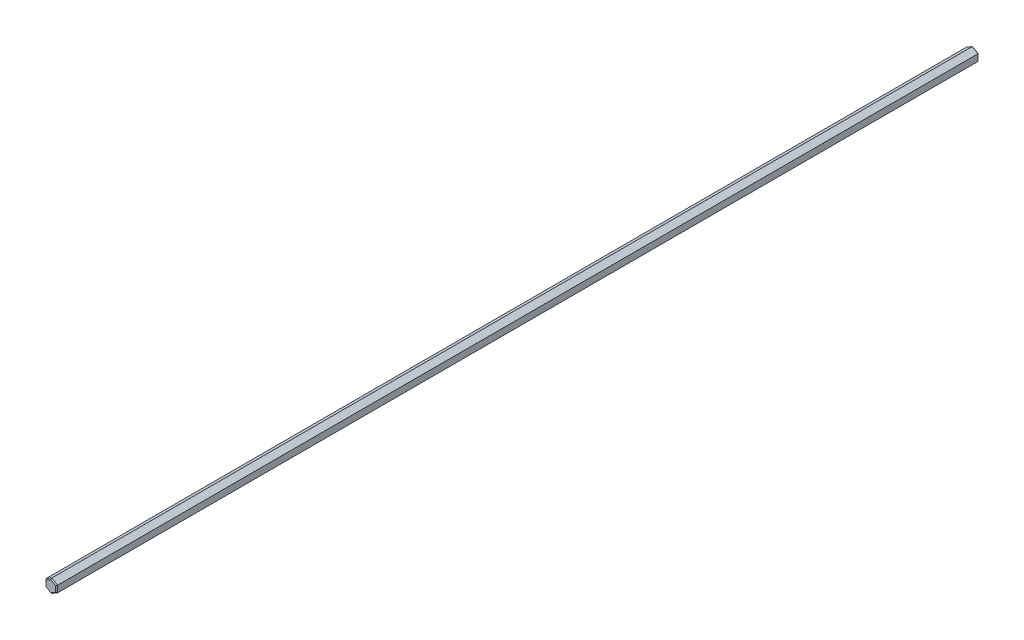
ISO-10303-21;
HEADER;
FILE_DESCRIPTION(('STEP AP214'),'2;1');
FILE_NAME('part.step','',(''),(''),'','','');
FILE_SCHEMA(('AUTOMOTIVE_DESIGN { 1 0 10303 214 1 1 1 1 }'));
ENDSEC;
DATA;
#1=APPLICATION_CONTEXT('core data for automotive mechanical design processes');
#2=APPLICATION_PROTOCOL_DEFINITION('international standard','automotive_design',2000,#1);
#3=PRODUCT_CONTEXT('',#1,'mechanical');
#4=PRODUCT('Part','Part','',(#3));
#5=PRODUCT_RELATED_PRODUCT_CATEGORY('part','',(#4));
#6=PRODUCT_DEFINITION_FORMATION('','',#4);
#7=PRODUCT_DEFINITION_CONTEXT('part definition',#1,'design');
#8=PRODUCT_DEFINITION('design','',#6,#7);
#9=PRODUCT_DEFINITION_SHAPE('','',#8);
#10=(LENGTH_UNIT() NAMED_UNIT(*) SI_UNIT(.MILLI.,.METRE.));
#11=(NAMED_UNIT(*) PLANE_ANGLE_UNIT() SI_UNIT($,.RADIAN.));
#12=(NAMED_UNIT(*) SI_UNIT($,.STERADIAN.) SOLID_ANGLE_UNIT());
#13=UNCERTAINTY_MEASURE_WITH_UNIT(LENGTH_MEASURE(1.E-05),#10,'distance_accuracy_value','');
#14=(GEOMETRIC_REPRESENTATION_CONTEXT(3) GLOBAL_UNCERTAINTY_ASSIGNED_CONTEXT((#13)) GLOBAL_UNIT_ASSIGNED_CONTEXT((#10,
#11,#12)) REPRESENTATION_CONTEXT('',''));
#15=CARTESIAN_POINT('',(0.,0.,0.));
#16=DIRECTION('',(0.,0.,1.));
#17=DIRECTION('',(1.,0.,0.));
#18=AXIS2_PLACEMENT_3D('',#15,#16,#17);
#19=CARTESIAN_POINT('',(-2.5,-1.44337567297406,0.));
#20=DIRECTION('',(-0.5,-0.866025403784439,0.));
#21=DIRECTION('',(0.866025403784439,-0.5,0.));
#22=AXIS2_PLACEMENT_3D('',#19,#20,#21);
#23=PLANE('',#22);
#24=DIRECTION('',(0.,0.,1.));
#25=VECTOR('',#24,1.);
#26=CARTESIAN_POINT('',(-2.5,-1.44337567297406,0.));
#27=LINE('',#26,#25);
#28=CARTESIAN_POINT('',(-2.5,-1.44337567297406,0.399999999999956));
#29=VERTEX_POINT('',#28);
#30=CARTESIAN_POINT('',(-2.5,-1.44337567297406,399.6));
#31=VERTEX_POINT('',#30);
#32=EDGE_CURVE('E149',#29,#31,#27,.T.);
#33=ORIENTED_EDGE('',*,*,#32,.F.);
#34=DIRECTION('',(0.866025403784439,-0.5,0.));
#35=VECTOR('',#34,1.);
#36=CARTESIAN_POINT('',(0.,-2.88675134594813,0.399999999999956));
#37=LINE('',#36,#35);
#38=CARTESIAN_POINT('',(0.,-2.88675134594813,0.399999999999956));
#39=VERTEX_POINT('',#38);
#40=EDGE_CURVE('E181',#29,#39,#37,.T.);
#41=ORIENTED_EDGE('',*,*,#40,.T.);
#42=DIRECTION('',(0.,0.,1.));
#43=VECTOR('',#42,1.);
#44=CARTESIAN_POINT('',(0.,-2.88675134594813,0.));
#45=LINE('',#44,#43);
#46=CARTESIAN_POINT('',(0.,-2.88675134594813,399.6));
#47=VERTEX_POINT('',#46);
#48=EDGE_CURVE('E214',#39,#47,#45,.T.);
#49=ORIENTED_EDGE('',*,*,#48,.T.);
#50=DIRECTION('',(-0.866025403784439,0.5,0.));
#51=VECTOR('',#50,1.);
#52=CARTESIAN_POINT('',(-2.5,-1.44337567297406,399.6));
#53=LINE('',#52,#51);
#54=EDGE_CURVE('E179',#47,#31,#53,.T.);
#55=ORIENTED_EDGE('',*,*,#54,.T.);
#56=EDGE_LOOP('',(#33,#41,#49,#55));
#57=FACE_BOUND('',#56,.T.);
#58=ADVANCED_FACE('F32',(#57),#23,.T.);
#59=CARTESIAN_POINT('',(-2.5,1.44337567297407,0.));
#60=DIRECTION('',(-1.,0.,0.));
#61=DIRECTION('',(0.,0.,1.));
#62=AXIS2_PLACEMENT_3D('',#59,#60,#61);
#63=PLANE('',#62);
#64=DIRECTION('',(0.,0.,1.));
#65=VECTOR('',#64,1.);
#66=CARTESIAN_POINT('',(-2.5,1.44337567297407,0.));
#67=LINE('',#66,#65);
#68=CARTESIAN_POINT('',(-2.5,1.44337567297407,0.399999999999956));
#69=VERTEX_POINT('',#68);
#70=CARTESIAN_POINT('',(-2.5,1.44337567297407,399.6));
#71=VERTEX_POINT('',#70);
#72=EDGE_CURVE('E130',#69,#71,#67,.T.);
#73=ORIENTED_EDGE('',*,*,#72,.F.);
#74=DIRECTION('',(0.,-1.,0.));
#75=VECTOR('',#74,1.);
#76=CARTESIAN_POINT('',(-2.5,-1.44337567297406,0.399999999999956));
#77=LINE('',#76,#75);
#78=EDGE_CURVE('E145',#69,#29,#77,.T.);
#79=ORIENTED_EDGE('',*,*,#78,.T.);
#80=ORIENTED_EDGE('',*,*,#32,.T.);
#81=DIRECTION('',(0.,1.,0.));
#82=VECTOR('',#81,1.);
#83=CARTESIAN_POINT('',(-2.5,1.44337567297407,399.6));
#84=LINE('',#83,#82);
#85=EDGE_CURVE('E148',#31,#71,#84,.T.);
#86=ORIENTED_EDGE('',*,*,#85,.T.);
#87=EDGE_LOOP('',(#73,#79,#80,#86));
#88=FACE_BOUND('',#87,.T.);
#89=ADVANCED_FACE('F142',(#88),#63,.T.);
#90=CARTESIAN_POINT('',(0.,2.88675134594813,0.));
#91=DIRECTION('',(-0.5,0.866025403784439,0.));
#92=DIRECTION('',(-0.866025403784439,-0.5,0.));
#93=AXIS2_PLACEMENT_3D('',#90,#91,#92);
#94=PLANE('',#93);
#95=DIRECTION('',(0.,0.,1.));
#96=VECTOR('',#95,1.);
#97=CARTESIAN_POINT('',(0.,2.88675134594813,0.));
#98=LINE('',#97,#96);
#99=CARTESIAN_POINT('',(0.,2.88675134594813,0.399999999999956));
#100=VERTEX_POINT('',#99);
#101=CARTESIAN_POINT('',(0.,2.88675134594813,399.6));
#102=VERTEX_POINT('',#101);
#103=EDGE_CURVE('E132',#100,#102,#98,.T.);
#104=ORIENTED_EDGE('',*,*,#103,.F.);
#105=DIRECTION('',(-0.866025403784439,-0.5,0.));
#106=VECTOR('',#105,1.);
#107=CARTESIAN_POINT('',(-2.5,1.44337567297407,0.399999999999956));
#108=LINE('',#107,#106);
#109=EDGE_CURVE('E126',#100,#69,#108,.T.);
#110=ORIENTED_EDGE('',*,*,#109,.T.);
#111=ORIENTED_EDGE('',*,*,#72,.T.);
#112=DIRECTION('',(0.866025403784439,0.5,0.));
#113=VECTOR('',#112,1.);
#114=CARTESIAN_POINT('',(0.,2.88675134594813,399.6));
#115=LINE('',#114,#113);
#116=EDGE_CURVE('E138',#71,#102,#115,.T.);
#117=ORIENTED_EDGE('',*,*,#116,.T.);
#118=EDGE_LOOP('',(#104,#110,#111,#117));
#119=FACE_BOUND('',#118,.T.);
#120=ADVANCED_FACE('F128',(#119),#94,.T.);
#121=CARTESIAN_POINT('',(2.5,1.44337567297406,0.));
#122=DIRECTION('',(0.5,0.866025403784439,0.));
#123=DIRECTION('',(-0.866025403784439,0.5,0.));
#124=AXIS2_PLACEMENT_3D('',#121,#122,#123);
#125=PLANE('',#124);
#126=DIRECTION('',(0.,0.,1.));
#127=VECTOR('',#126,1.);
#128=CARTESIAN_POINT('',(2.5,1.44337567297406,0.));
#129=LINE('',#128,#127);
#130=CARTESIAN_POINT('',(2.5,1.44337567297406,0.399999999999956));
#131=VERTEX_POINT('',#130);
#132=CARTESIAN_POINT('',(2.5,1.44337567297406,399.6));
#133=VERTEX_POINT('',#132);
#134=EDGE_CURVE('E248',#131,#133,#129,.T.);
#135=ORIENTED_EDGE('',*,*,#134,.F.);
#136=DIRECTION('',(-0.866025403784439,0.5,0.));
#137=VECTOR('',#136,1.);
#138=CARTESIAN_POINT('',(0.,2.88675134594813,0.399999999999956));
#139=LINE('',#138,#137);
#140=EDGE_CURVE('E189',#131,#100,#139,.T.);
#141=ORIENTED_EDGE('',*,*,#140,.T.);
#142=ORIENTED_EDGE('',*,*,#103,.T.);
#143=DIRECTION('',(0.866025403784439,-0.5,0.));
#144=VECTOR('',#143,1.);
#145=CARTESIAN_POINT('',(2.5,1.44337567297406,399.6));
#146=LINE('',#145,#144);
#147=EDGE_CURVE('E187',#102,#133,#146,.T.);
#148=ORIENTED_EDGE('',*,*,#147,.T.);
#149=EDGE_LOOP('',(#135,#141,#142,#148));
#150=FACE_BOUND('',#149,.T.);
#151=ADVANCED_FACE('F265',(#150),#125,.T.);
#152=CARTESIAN_POINT('',(2.5,-1.44337567297406,0.));
#153=DIRECTION('',(1.,0.,0.));
#154=DIRECTION('',(0.,0.,-1.));
#155=AXIS2_PLACEMENT_3D('',#152,#153,#154);
#156=PLANE('',#155);
#157=DIRECTION('',(0.,0.,1.));
#158=VECTOR('',#157,1.);
#159=CARTESIAN_POINT('',(2.5,-1.44337567297406,0.));
#160=LINE('',#159,#158);
#161=CARTESIAN_POINT('',(2.5,-1.44337567297406,0.399999999999956));
#162=VERTEX_POINT('',#161);
#163=CARTESIAN_POINT('',(2.5,-1.44337567297406,399.6));
#164=VERTEX_POINT('',#163);
#165=EDGE_CURVE('E246',#162,#164,#160,.T.);
#166=ORIENTED_EDGE('',*,*,#165,.F.);
#167=DIRECTION('',(0.,1.,0.));
#168=VECTOR('',#167,1.);
#169=CARTESIAN_POINT('',(2.5,1.44337567297406,0.399999999999956));
#170=LINE('',#169,#168);
#171=EDGE_CURVE('E193',#162,#131,#170,.T.);
#172=ORIENTED_EDGE('',*,*,#171,.T.);
#173=ORIENTED_EDGE('',*,*,#134,.T.);
#174=DIRECTION('',(0.,-1.,0.));
#175=VECTOR('',#174,1.);
#176=CARTESIAN_POINT('',(2.5,-1.44337567297406,399.6));
#177=LINE('',#176,#175);
#178=EDGE_CURVE('E191',#133,#164,#177,.T.);
#179=ORIENTED_EDGE('',*,*,#178,.T.);
#180=EDGE_LOOP('',(#166,#172,#173,#179));
#181=FACE_BOUND('',#180,.T.);
#182=ADVANCED_FACE('F302',(#181),#156,.T.);
#183=CARTESIAN_POINT('',(0.,-2.88675134594813,0.));
#184=DIRECTION('',(0.5,-0.866025403784439,0.));
#185=DIRECTION('',(0.866025403784439,0.5,0.));
#186=AXIS2_PLACEMENT_3D('',#183,#184,#185);
#187=PLANE('',#186);
#188=ORIENTED_EDGE('',*,*,#48,.F.);
#189=DIRECTION('',(0.866025403784439,0.5,0.));
#190=VECTOR('',#189,1.);
#191=CARTESIAN_POINT('',(2.5,-1.44337567297406,0.399999999999956));
#192=LINE('',#191,#190);
#193=EDGE_CURVE('E185',#39,#162,#192,.T.);
#194=ORIENTED_EDGE('',*,*,#193,.T.);
#195=ORIENTED_EDGE('',*,*,#165,.T.);
#196=DIRECTION('',(-0.866025403784439,-0.5,0.));
#197=VECTOR('',#196,1.);
#198=CARTESIAN_POINT('',(0.,-2.88675134594813,399.6));
#199=LINE('',#198,#197);
#200=EDGE_CURVE('E137',#164,#47,#199,.T.);
#201=ORIENTED_EDGE('',*,*,#200,.T.);
#202=EDGE_LOOP('',(#188,#194,#195,#201));
#203=FACE_BOUND('',#202,.T.);
#204=ADVANCED_FACE('F243',(#203),#187,.T.);
#205=CARTESIAN_POINT('',(0.,0.,0.));
#206=DIRECTION('',(0.,0.,1.));
#207=DIRECTION('',(1.,0.,0.));
#208=AXIS2_PLACEMENT_3D('',#205,#206,#207);
#209=PLANE('',#208);
#210=DIRECTION('',(-0.866025403784439,0.5,0.));
#211=VECTOR('',#210,1.);
#212=CARTESIAN_POINT('',(-2.29999999999999,-1.09696551146028,0.));
#213=LINE('',#212,#211);
#214=CARTESIAN_POINT('',(0.,-2.42487113059641,0.));
#215=VERTEX_POINT('',#214);
#216=CARTESIAN_POINT('',(-2.09999999999999,-1.21243556529821,0.));
#217=VERTEX_POINT('',#216);
#218=EDGE_CURVE('E175',#215,#217,#213,.T.);
#219=ORIENTED_EDGE('',*,*,#218,.T.);
#220=DIRECTION('',(0.,1.,0.));
#221=VECTOR('',#220,1.);
#222=CARTESIAN_POINT('',(-2.09999999999999,1.44337567297407,0.));
#223=LINE('',#222,#221);
#224=CARTESIAN_POINT('',(-2.09999999999999,1.21243556529821,0.));
#225=VERTEX_POINT('',#224);
#226=EDGE_CURVE('E177',#217,#225,#223,.T.);
#227=ORIENTED_EDGE('',*,*,#226,.T.);
#228=DIRECTION('',(0.866025403784439,0.5,0.));
#229=VECTOR('',#228,1.);
#230=CARTESIAN_POINT('',(0.200000000000004,2.54034118443434,0.));
#231=LINE('',#230,#229);
#232=CARTESIAN_POINT('',(0.,2.42487113059641,0.));
#233=VERTEX_POINT('',#232);
#234=EDGE_CURVE('E154',#225,#233,#231,.T.);
#235=ORIENTED_EDGE('',*,*,#234,.T.);
#236=DIRECTION('',(0.866025403784439,-0.5,0.));
#237=VECTOR('',#236,1.);
#238=CARTESIAN_POINT('',(2.29999999999999,1.09696551146028,0.));
#239=LINE('',#238,#237);
#240=CARTESIAN_POINT('',(2.09999999999999,1.21243556529821,0.));
#241=VERTEX_POINT('',#240);
#242=EDGE_CURVE('E166',#233,#241,#239,.T.);
#243=ORIENTED_EDGE('',*,*,#242,.T.);
#244=DIRECTION('',(0.,-1.,0.));
#245=VECTOR('',#244,1.);
#246=CARTESIAN_POINT('',(2.09999999999999,-1.44337567297406,0.));
#247=LINE('',#246,#245);
#248=CARTESIAN_POINT('',(2.09999999999999,-1.21243556529821,0.));
#249=VERTEX_POINT('',#248);
#250=EDGE_CURVE('E164',#241,#249,#247,.T.);
#251=ORIENTED_EDGE('',*,*,#250,.T.);
#252=DIRECTION('',(-0.866025403784439,-0.5,0.));
#253=VECTOR('',#252,1.);
#254=CARTESIAN_POINT('',(-0.200000000000006,-2.54034118443434,0.));
#255=LINE('',#254,#253);
#256=EDGE_CURVE('E172',#249,#215,#255,.T.);
#257=ORIENTED_EDGE('',*,*,#256,.T.);
#258=EDGE_LOOP('',(#219,#227,#235,#243,#251,#257));
#259=FACE_BOUND('',#258,.T.);
#260=ADVANCED_FACE('F273',(#259),#209,.F.);
#261=CARTESIAN_POINT('',(0.,0.,400.));
#262=DIRECTION('',(0.,0.,1.));
#263=DIRECTION('',(1.,0.,0.));
#264=AXIS2_PLACEMENT_3D('',#261,#262,#263);
#265=PLANE('',#264);
#266=DIRECTION('',(-0.866025403784439,0.5,0.));
#267=VECTOR('',#266,1.);
#268=CARTESIAN_POINT('',(1.04999999999998,1.81865334794729,400.));
#269=LINE('',#268,#267);
#270=CARTESIAN_POINT('',(2.09999999999997,1.21243556529819,400.));
#271=VERTEX_POINT('',#270);
#272=CARTESIAN_POINT('',(0.,2.42487113059639,400.));
#273=VERTEX_POINT('',#272);
#274=EDGE_CURVE('E56',#271,#273,#269,.T.);
#275=ORIENTED_EDGE('',*,*,#274,.T.);
#276=DIRECTION('',(-0.866025403784439,-0.5,0.));
#277=VECTOR('',#276,1.);
#278=CARTESIAN_POINT('',(-1.04999999999998,1.81865334794729,400.));
#279=LINE('',#278,#277);
#280=CARTESIAN_POINT('',(-2.09999999999997,1.2124355652982,400.));
#281=VERTEX_POINT('',#280);
#282=EDGE_CURVE('E11',#273,#281,#279,.T.);
#283=ORIENTED_EDGE('',*,*,#282,.T.);
#284=DIRECTION('',(0.,-1.,0.));
#285=VECTOR('',#284,1.);
#286=CARTESIAN_POINT('',(-2.09999999999997,0.,400.));
#287=LINE('',#286,#285);
#288=CARTESIAN_POINT('',(-2.09999999999997,-1.2124355652982,400.));
#289=VERTEX_POINT('',#288);
#290=EDGE_CURVE('E41',#281,#289,#287,.T.);
#291=ORIENTED_EDGE('',*,*,#290,.T.);
#292=DIRECTION('',(0.866025403784439,-0.5,0.));
#293=VECTOR('',#292,1.);
#294=CARTESIAN_POINT('',(-1.04999999999998,-1.81865334794729,400.));
#295=LINE('',#294,#293);
#296=CARTESIAN_POINT('',(0.,-2.42487113059639,400.));
#297=VERTEX_POINT('',#296);
#298=EDGE_CURVE('E199',#289,#297,#295,.T.);
#299=ORIENTED_EDGE('',*,*,#298,.T.);
#300=DIRECTION('',(0.866025403784439,0.5,0.));
#301=VECTOR('',#300,1.);
#302=CARTESIAN_POINT('',(1.04999999999998,-1.81865334794729,400.));
#303=LINE('',#302,#301);
#304=CARTESIAN_POINT('',(2.09999999999997,-1.21243556529819,400.));
#305=VERTEX_POINT('',#304);
#306=EDGE_CURVE('E195',#297,#305,#303,.T.);
#307=ORIENTED_EDGE('',*,*,#306,.T.);
#308=DIRECTION('',(0.,1.,0.));
#309=VECTOR('',#308,1.);
#310=CARTESIAN_POINT('',(2.09999999999997,0.,400.));
#311=LINE('',#310,#309);
#312=EDGE_CURVE('E197',#305,#271,#311,.T.);
#313=ORIENTED_EDGE('',*,*,#312,.T.);
#314=EDGE_LOOP('',(#275,#283,#291,#299,#307,#313));
#315=FACE_BOUND('',#314,.T.);
#316=ADVANCED_FACE('F258',(#315),#265,.T.);
#317=CARTESIAN_POINT('',(2.5,-1.44337567297406,0.399999999999956));
#318=DIRECTION('',(0.707106781186499,0.,-0.707106781186597));
#319=DIRECTION('',(0.,-1.,0.));
#320=AXIS2_PLACEMENT_3D('',#317,#318,#319);
#321=PLANE('',#320);
#322=DIRECTION('',(-0.654653670708016,0.37796447300925,-0.654653670707925));
#323=VECTOR('',#322,1.);
#324=CARTESIAN_POINT('',(2.5,-1.44337567297406,0.399999999999956));
#325=LINE('',#324,#323);
#326=EDGE_CURVE('E208',#249,#162,#325,.F.);
#327=ORIENTED_EDGE('',*,*,#326,.F.);
#328=ORIENTED_EDGE('',*,*,#250,.F.);
#329=DIRECTION('',(0.654653670708016,0.37796447300925,0.654653670707925));
#330=VECTOR('',#329,1.);
#331=CARTESIAN_POINT('',(1.7857142857142,1.03098262355285,-0.314285714285745));
#332=LINE('',#331,#330);
#333=EDGE_CURVE('E211',#131,#241,#332,.F.);
#334=ORIENTED_EDGE('',*,*,#333,.F.);
#335=ORIENTED_EDGE('',*,*,#171,.F.);
#336=EDGE_LOOP('',(#327,#328,#334,#335));
#337=FACE_BOUND('',#336,.T.);
#338=ADVANCED_FACE('F276',(#337),#321,.T.);
#339=CARTESIAN_POINT('',(2.5,1.44337567297406,0.399999999999956));
#340=DIRECTION('',(0.353553390593249,0.612372435695752,-0.707106781186597));
#341=DIRECTION('',(0.866025403784439,-0.5,0.));
#342=AXIS2_PLACEMENT_3D('',#339,#340,#341);
#343=PLANE('',#342);
#344=ORIENTED_EDGE('',*,*,#333,.T.);
#345=ORIENTED_EDGE('',*,*,#242,.F.);
#346=DIRECTION('',(0.,0.755928946018499,0.654653670707925));
#347=VECTOR('',#346,1.);
#348=CARTESIAN_POINT('',(0.,2.06196524710571,-0.314285714285743));
#349=LINE('',#348,#347);
#350=EDGE_CURVE('E206',#100,#233,#349,.F.);
#351=ORIENTED_EDGE('',*,*,#350,.F.);
#352=ORIENTED_EDGE('',*,*,#140,.F.);
#353=EDGE_LOOP('',(#344,#345,#351,#352));
#354=FACE_BOUND('',#353,.T.);
#355=ADVANCED_FACE('F269',(#354),#343,.T.);
#356=CARTESIAN_POINT('',(0.,-2.88675134594813,0.399999999999956));
#357=DIRECTION('',(0.353553390593249,-0.612372435695752,-0.707106781186597));
#358=DIRECTION('',(-0.866025403784439,-0.5,0.));
#359=AXIS2_PLACEMENT_3D('',#356,#357,#358);
#360=PLANE('',#359);
#361=ORIENTED_EDGE('',*,*,#326,.T.);
#362=ORIENTED_EDGE('',*,*,#193,.F.);
#363=DIRECTION('',(0.,0.755928946018499,-0.654653670707925));
#364=VECTOR('',#363,1.);
#365=CARTESIAN_POINT('',(0.,-2.88675134594813,0.399999999999956));
#366=LINE('',#365,#364);
#367=EDGE_CURVE('E158',#215,#39,#366,.F.);
#368=ORIENTED_EDGE('',*,*,#367,.F.);
#369=ORIENTED_EDGE('',*,*,#256,.F.);
#370=EDGE_LOOP('',(#361,#362,#368,#369));
#371=FACE_BOUND('',#370,.T.);
#372=ADVANCED_FACE('F281',(#371),#360,.T.);
#373=CARTESIAN_POINT('',(0.,2.88675134594813,0.399999999999956));
#374=DIRECTION('',(-0.353553390593249,0.612372435695752,-0.707106781186597));
#375=DIRECTION('',(0.866025403784439,0.5,0.));
#376=AXIS2_PLACEMENT_3D('',#373,#374,#375);
#377=PLANE('',#376);
#378=ORIENTED_EDGE('',*,*,#350,.T.);
#379=ORIENTED_EDGE('',*,*,#234,.F.);
#380=DIRECTION('',(-0.654653670708016,0.37796447300925,0.654653670707925));
#381=VECTOR('',#380,1.);
#382=CARTESIAN_POINT('',(-1.7857142857142,1.03098262355286,-0.314285714285744));
#383=LINE('',#382,#381);
#384=EDGE_CURVE('E152',#69,#225,#383,.F.);
#385=ORIENTED_EDGE('',*,*,#384,.F.);
#386=ORIENTED_EDGE('',*,*,#109,.F.);
#387=EDGE_LOOP('',(#378,#379,#385,#386));
#388=FACE_BOUND('',#387,.T.);
#389=ADVANCED_FACE('F153',(#388),#377,.T.);
#390=CARTESIAN_POINT('',(-2.5,-1.44337567297406,0.399999999999956));
#391=DIRECTION('',(-0.353553390593249,-0.612372435695752,-0.707106781186596));
#392=DIRECTION('',(-0.866025403784439,0.5,0.));
#393=AXIS2_PLACEMENT_3D('',#390,#391,#392);
#394=PLANE('',#393);
#395=ORIENTED_EDGE('',*,*,#367,.T.);
#396=ORIENTED_EDGE('',*,*,#40,.F.);
#397=DIRECTION('',(0.654653670708016,0.377964473009249,-0.654653670707925));
#398=VECTOR('',#397,1.);
#399=CARTESIAN_POINT('',(-2.5,-1.44337567297406,0.399999999999956));
#400=LINE('',#399,#398);
#401=EDGE_CURVE('E159',#217,#29,#400,.F.);
#402=ORIENTED_EDGE('',*,*,#401,.F.);
#403=ORIENTED_EDGE('',*,*,#218,.F.);
#404=EDGE_LOOP('',(#395,#396,#402,#403));
#405=FACE_BOUND('',#404,.T.);
#406=ADVANCED_FACE('F284',(#405),#394,.T.);
#407=CARTESIAN_POINT('',(-2.5,1.44337567297407,0.399999999999956));
#408=DIRECTION('',(-0.707106781186499,0.,-0.707106781186597));
#409=DIRECTION('',(0.,1.,0.));
#410=AXIS2_PLACEMENT_3D('',#407,#408,#409);
#411=PLANE('',#410);
#412=ORIENTED_EDGE('',*,*,#384,.T.);
#413=ORIENTED_EDGE('',*,*,#226,.F.);
#414=ORIENTED_EDGE('',*,*,#401,.T.);
#415=ORIENTED_EDGE('',*,*,#78,.F.);
#416=EDGE_LOOP('',(#412,#413,#414,#415));
#417=FACE_BOUND('',#416,.T.);
#418=ADVANCED_FACE('F161',(#417),#411,.T.);
#419=CARTESIAN_POINT('',(1.04999999999998,-1.81865334794729,400.));
#420=DIRECTION('',(-0.353553390593264,0.612372435695778,-0.707106781186566));
#421=DIRECTION('',(0.866025403784439,0.5,0.));
#422=AXIS2_PLACEMENT_3D('',#419,#420,#421);
#423=PLANE('',#422);
#424=DIRECTION('',(0.,-0.755928946018472,-0.654653670707957));
#425=VECTOR('',#424,1.);
#426=CARTESIAN_POINT('',(0.,-2.0784609690826,400.3));
#427=LINE('',#426,#425);
#428=EDGE_CURVE('E223',#47,#297,#427,.F.);
#429=ORIENTED_EDGE('',*,*,#428,.F.);
#430=ORIENTED_EDGE('',*,*,#200,.F.);
#431=DIRECTION('',(-0.654653670707992,0.377964473009236,0.654653670707957));
#432=VECTOR('',#431,1.);
#433=CARTESIAN_POINT('',(1.79999999999996,-1.0392304845413,400.3));
#434=LINE('',#433,#432);
#435=EDGE_CURVE('E36',#305,#164,#434,.F.);
#436=ORIENTED_EDGE('',*,*,#435,.F.);
#437=ORIENTED_EDGE('',*,*,#306,.F.);
#438=EDGE_LOOP('',(#429,#430,#436,#437));
#439=FACE_BOUND('',#438,.T.);
#440=ADVANCED_FACE('F34',(#439),#423,.F.);
#441=CARTESIAN_POINT('',(2.09999999999997,0.,400.));
#442=DIRECTION('',(-0.707106781186529,0.,-0.707106781186566));
#443=DIRECTION('',(0.,1.,0.));
#444=AXIS2_PLACEMENT_3D('',#441,#442,#443);
#445=PLANE('',#444);
#446=ORIENTED_EDGE('',*,*,#435,.T.);
#447=ORIENTED_EDGE('',*,*,#178,.F.);
#448=DIRECTION('',(-0.654653670707992,-0.377964473009236,0.654653670707957));
#449=VECTOR('',#448,1.);
#450=CARTESIAN_POINT('',(1.79999999999996,1.0392304845413,400.3));
#451=LINE('',#450,#449);
#452=EDGE_CURVE('E221',#271,#133,#451,.F.);
#453=ORIENTED_EDGE('',*,*,#452,.F.);
#454=ORIENTED_EDGE('',*,*,#312,.F.);
#455=EDGE_LOOP('',(#446,#447,#453,#454));
#456=FACE_BOUND('',#455,.T.);
#457=ADVANCED_FACE('F234',(#456),#445,.F.);
#458=CARTESIAN_POINT('',(-1.04999999999998,-1.81865334794729,400.));
#459=DIRECTION('',(0.353553390593264,0.612372435695778,-0.707106781186566));
#460=DIRECTION('',(0.866025403784439,-0.5,0.));
#461=AXIS2_PLACEMENT_3D('',#458,#459,#460);
#462=PLANE('',#461);
#463=ORIENTED_EDGE('',*,*,#428,.T.);
#464=ORIENTED_EDGE('',*,*,#298,.F.);
#465=DIRECTION('',(-0.654653670707992,-0.377964473009236,-0.654653670707957));
#466=VECTOR('',#465,1.);
#467=CARTESIAN_POINT('',(-1.79999999999996,-1.0392304845413,400.3));
#468=LINE('',#467,#466);
#469=EDGE_CURVE('E218',#31,#289,#468,.F.);
#470=ORIENTED_EDGE('',*,*,#469,.F.);
#471=ORIENTED_EDGE('',*,*,#54,.F.);
#472=EDGE_LOOP('',(#463,#464,#470,#471));
#473=FACE_BOUND('',#472,.T.);
#474=ADVANCED_FACE('F255',(#473),#462,.F.);
#475=CARTESIAN_POINT('',(1.04999999999998,1.81865334794729,400.));
#476=DIRECTION('',(-0.353553390593264,-0.612372435695778,-0.707106781186566));
#477=DIRECTION('',(-0.866025403784439,0.5,0.));
#478=AXIS2_PLACEMENT_3D('',#475,#476,#477);
#479=PLANE('',#478);
#480=ORIENTED_EDGE('',*,*,#452,.T.);
#481=ORIENTED_EDGE('',*,*,#147,.F.);
#482=DIRECTION('',(0.,-0.755928946018472,0.654653670707957));
#483=VECTOR('',#482,1.);
#484=CARTESIAN_POINT('',(0.,2.0784609690826,400.3));
#485=LINE('',#484,#483);
#486=EDGE_CURVE('E216',#273,#102,#485,.F.);
#487=ORIENTED_EDGE('',*,*,#486,.F.);
#488=ORIENTED_EDGE('',*,*,#274,.F.);
#489=EDGE_LOOP('',(#480,#481,#487,#488));
#490=FACE_BOUND('',#489,.T.);
#491=ADVANCED_FACE('F262',(#490),#479,.F.);
#492=CARTESIAN_POINT('',(-2.09999999999997,0.,400.));
#493=DIRECTION('',(0.707106781186529,0.,-0.707106781186566));
#494=DIRECTION('',(0.,-1.,0.));
#495=AXIS2_PLACEMENT_3D('',#492,#493,#494);
#496=PLANE('',#495);
#497=ORIENTED_EDGE('',*,*,#469,.T.);
#498=ORIENTED_EDGE('',*,*,#290,.F.);
#499=DIRECTION('',(-0.654653670707992,0.377964473009236,-0.654653670707957));
#500=VECTOR('',#499,1.);
#501=CARTESIAN_POINT('',(-1.79999999999996,1.0392304845413,400.3));
#502=LINE('',#501,#500);
#503=EDGE_CURVE('E49',#71,#281,#502,.F.);
#504=ORIENTED_EDGE('',*,*,#503,.F.);
#505=ORIENTED_EDGE('',*,*,#85,.F.);
#506=EDGE_LOOP('',(#497,#498,#504,#505));
#507=FACE_BOUND('',#506,.T.);
#508=ADVANCED_FACE('F257',(#507),#496,.F.);
#509=CARTESIAN_POINT('',(-1.04999999999998,1.81865334794729,400.));
#510=DIRECTION('',(0.353553390593264,-0.612372435695778,-0.707106781186566));
#511=DIRECTION('',(-0.866025403784439,-0.5,0.));
#512=AXIS2_PLACEMENT_3D('',#509,#510,#511);
#513=PLANE('',#512);
#514=ORIENTED_EDGE('',*,*,#486,.T.);
#515=ORIENTED_EDGE('',*,*,#116,.F.);
#516=ORIENTED_EDGE('',*,*,#503,.T.);
#517=ORIENTED_EDGE('',*,*,#282,.F.);
#518=EDGE_LOOP('',(#514,#515,#516,#517));
#519=FACE_BOUND('',#518,.T.);
#520=ADVANCED_FACE('F259',(#519),#513,.F.);
#521=CLOSED_SHELL('',(#58,#89,#120,#151,#182,#204,#260,#316,#338,#355,#372,#389,#406,#418,#440,
#457,#474,#491,#508,#520));
#522=MANIFOLD_SOLID_BREP('B2',#521);
#523=ADVANCED_BREP_SHAPE_REPRESENTATION('',(#18,#522),#14);
#524=SHAPE_DEFINITION_REPRESENTATION(#9,#523);
ENDSEC;
END-ISO-10303-21;
